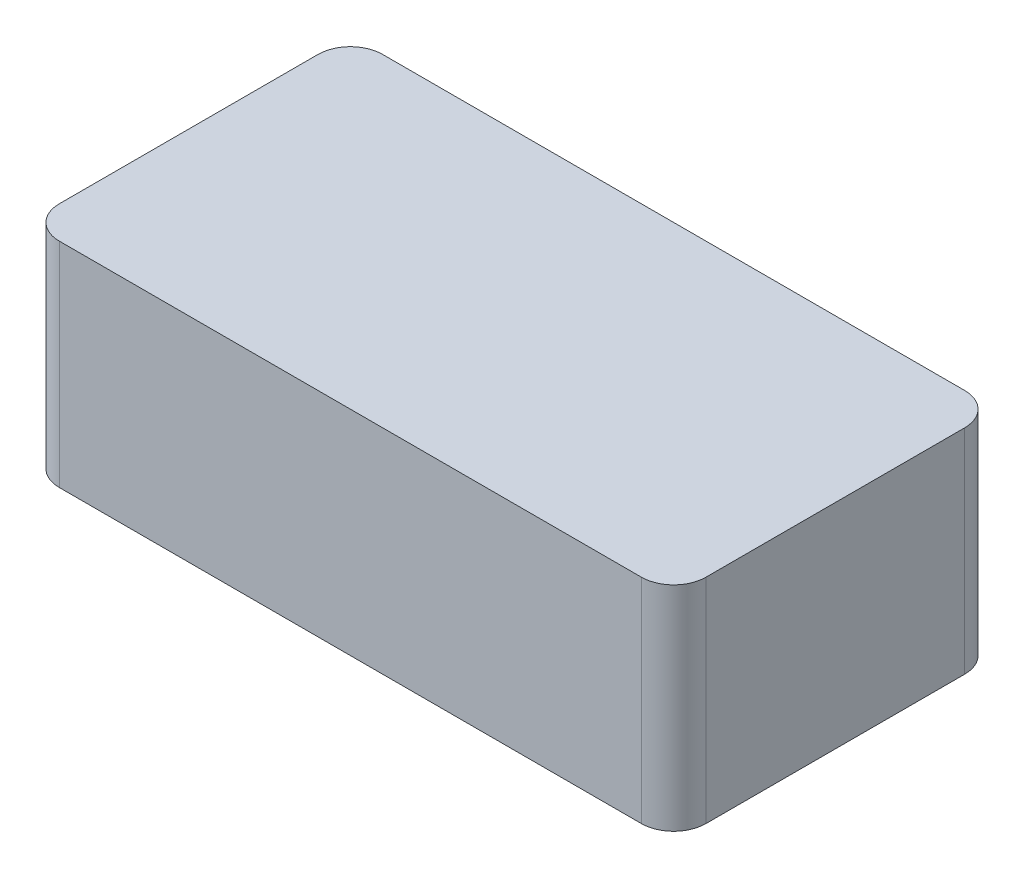
ISO-10303-21;
HEADER;
FILE_DESCRIPTION(('STEP AP214'),'2;1');
FILE_NAME('part.step','',(''),(''),'','','');
FILE_SCHEMA(('AUTOMOTIVE_DESIGN { 1 0 10303 214 1 1 1 1 }'));
ENDSEC;
DATA;
#1=APPLICATION_CONTEXT('core data for automotive mechanical design processes');
#2=APPLICATION_PROTOCOL_DEFINITION('international standard','automotive_design',2000,#1);
#3=PRODUCT_CONTEXT('',#1,'mechanical');
#4=PRODUCT('Part','Part','',(#3));
#5=PRODUCT_RELATED_PRODUCT_CATEGORY('part','',(#4));
#6=PRODUCT_DEFINITION_FORMATION('','',#4);
#7=PRODUCT_DEFINITION_CONTEXT('part definition',#1,'design');
#8=PRODUCT_DEFINITION('design','',#6,#7);
#9=PRODUCT_DEFINITION_SHAPE('','',#8);
#10=(LENGTH_UNIT() NAMED_UNIT(*) SI_UNIT(.MILLI.,.METRE.));
#11=(NAMED_UNIT(*) PLANE_ANGLE_UNIT() SI_UNIT($,.RADIAN.));
#12=(NAMED_UNIT(*) SI_UNIT($,.STERADIAN.) SOLID_ANGLE_UNIT());
#13=UNCERTAINTY_MEASURE_WITH_UNIT(LENGTH_MEASURE(1.E-05),#10,'distance_accuracy_value','');
#14=(GEOMETRIC_REPRESENTATION_CONTEXT(3) GLOBAL_UNCERTAINTY_ASSIGNED_CONTEXT((#13)) GLOBAL_UNIT_ASSIGNED_CONTEXT((#10,
#11,#12)) REPRESENTATION_CONTEXT('',''));
#15=CARTESIAN_POINT('',(0.,0.,0.));
#16=DIRECTION('',(0.,0.,1.));
#17=DIRECTION('',(1.,0.,0.));
#18=AXIS2_PLACEMENT_3D('',#15,#16,#17);
#19=CARTESIAN_POINT('',(0.,13.2,0.));
#20=DIRECTION('',(1.,0.,0.));
#21=DIRECTION('',(0.,0.,-1.));
#22=AXIS2_PLACEMENT_3D('',#19,#20,#21);
#23=PLANE('',#22);
#24=DIRECTION('',(0.,0.,1.));
#25=VECTOR('',#24,1.);
#26=CARTESIAN_POINT('',(0.,13.2,0.));
#27=LINE('',#26,#25);
#28=CARTESIAN_POINT('',(0.,13.2,-18.));
#29=VERTEX_POINT('',#28);
#30=CARTESIAN_POINT('',(0.,13.2,-2.));
#31=VERTEX_POINT('',#30);
#32=EDGE_CURVE('E123',#29,#31,#27,.T.);
#33=ORIENTED_EDGE('',*,*,#32,.F.);
#34=DIRECTION('',(0.,-1.,0.));
#35=VECTOR('',#34,1.);
#36=CARTESIAN_POINT('',(0.,13.2,-18.));
#37=LINE('',#36,#35);
#38=CARTESIAN_POINT('',(0.,0.,-18.));
#39=VERTEX_POINT('',#38);
#40=EDGE_CURVE('E108',#29,#39,#37,.T.);
#41=ORIENTED_EDGE('',*,*,#40,.T.);
#42=DIRECTION('',(0.,0.,1.));
#43=VECTOR('',#42,1.);
#44=CARTESIAN_POINT('',(0.,0.,0.));
#45=LINE('',#44,#43);
#46=CARTESIAN_POINT('',(0.,0.,-2.));
#47=VERTEX_POINT('',#46);
#48=EDGE_CURVE('E120',#39,#47,#45,.T.);
#49=ORIENTED_EDGE('',*,*,#48,.T.);
#50=DIRECTION('',(0.,-1.,0.));
#51=VECTOR('',#50,1.);
#52=CARTESIAN_POINT('',(0.,13.2,-2.));
#53=LINE('',#52,#51);
#54=EDGE_CURVE('E125',#47,#31,#53,.F.);
#55=ORIENTED_EDGE('',*,*,#54,.T.);
#56=EDGE_LOOP('',(#33,#41,#49,#55));
#57=FACE_BOUND('',#56,.T.);
#58=ADVANCED_FACE('F39',(#57),#23,.F.);
#59=CARTESIAN_POINT('',(0.,13.2,0.));
#60=DIRECTION('',(0.,0.,-1.));
#61=DIRECTION('',(-1.,0.,0.));
#62=AXIS2_PLACEMENT_3D('',#59,#60,#61);
#63=PLANE('',#62);
#64=DIRECTION('',(1.,0.,0.));
#65=VECTOR('',#64,1.);
#66=CARTESIAN_POINT('',(0.,13.2,0.));
#67=LINE('',#66,#65);
#68=CARTESIAN_POINT('',(2.,13.2,0.));
#69=VERTEX_POINT('',#68);
#70=CARTESIAN_POINT('',(38.,13.2,0.));
#71=VERTEX_POINT('',#70);
#72=EDGE_CURVE('E174',#69,#71,#67,.T.);
#73=ORIENTED_EDGE('',*,*,#72,.F.);
#74=DIRECTION('',(0.,-1.,0.));
#75=VECTOR('',#74,1.);
#76=CARTESIAN_POINT('',(2.,13.2,0.));
#77=LINE('',#76,#75);
#78=CARTESIAN_POINT('',(2.,0.,0.));
#79=VERTEX_POINT('',#78);
#80=EDGE_CURVE('E158',#69,#79,#77,.T.);
#81=ORIENTED_EDGE('',*,*,#80,.T.);
#82=DIRECTION('',(1.,0.,0.));
#83=VECTOR('',#82,1.);
#84=CARTESIAN_POINT('',(0.,0.,0.));
#85=LINE('',#84,#83);
#86=CARTESIAN_POINT('',(38.,0.,0.));
#87=VERTEX_POINT('',#86);
#88=EDGE_CURVE('E129',#79,#87,#85,.T.);
#89=ORIENTED_EDGE('',*,*,#88,.T.);
#90=DIRECTION('',(0.,-1.,0.));
#91=VECTOR('',#90,1.);
#92=CARTESIAN_POINT('',(38.,13.2,0.));
#93=LINE('',#92,#91);
#94=EDGE_CURVE('E156',#87,#71,#93,.F.);
#95=ORIENTED_EDGE('',*,*,#94,.T.);
#96=EDGE_LOOP('',(#73,#81,#89,#95));
#97=FACE_BOUND('',#96,.T.);
#98=ADVANCED_FACE('F184',(#97),#63,.F.);
#99=CARTESIAN_POINT('',(40.,13.2,0.));
#100=DIRECTION('',(-1.,0.,0.));
#101=DIRECTION('',(0.,0.,1.));
#102=AXIS2_PLACEMENT_3D('',#99,#100,#101);
#103=PLANE('',#102);
#104=DIRECTION('',(0.,0.,-1.));
#105=VECTOR('',#104,1.);
#106=CARTESIAN_POINT('',(40.,0.,0.));
#107=LINE('',#106,#105);
#108=CARTESIAN_POINT('',(40.,0.,-2.));
#109=VERTEX_POINT('',#108);
#110=CARTESIAN_POINT('',(40.,0.,-18.));
#111=VERTEX_POINT('',#110);
#112=EDGE_CURVE('E132',#109,#111,#107,.T.);
#113=ORIENTED_EDGE('',*,*,#112,.T.);
#114=DIRECTION('',(0.,-1.,0.));
#115=VECTOR('',#114,1.);
#116=CARTESIAN_POINT('',(40.,13.2,-18.));
#117=LINE('',#116,#115);
#118=CARTESIAN_POINT('',(40.,13.2,-18.));
#119=VERTEX_POINT('',#118);
#120=EDGE_CURVE('E11',#111,#119,#117,.F.);
#121=ORIENTED_EDGE('',*,*,#120,.T.);
#122=DIRECTION('',(0.,0.,-1.));
#123=VECTOR('',#122,1.);
#124=CARTESIAN_POINT('',(40.,13.2,0.));
#125=LINE('',#124,#123);
#126=CARTESIAN_POINT('',(40.,13.2,-2.));
#127=VERTEX_POINT('',#126);
#128=EDGE_CURVE('E164',#127,#119,#125,.T.);
#129=ORIENTED_EDGE('',*,*,#128,.F.);
#130=DIRECTION('',(0.,-1.,0.));
#131=VECTOR('',#130,1.);
#132=CARTESIAN_POINT('',(40.,13.2,-2.));
#133=LINE('',#132,#131);
#134=EDGE_CURVE('E47',#127,#109,#133,.T.);
#135=ORIENTED_EDGE('',*,*,#134,.T.);
#136=EDGE_LOOP('',(#113,#121,#129,#135));
#137=FACE_BOUND('',#136,.T.);
#138=ADVANCED_FACE('F163',(#137),#103,.F.);
#139=CARTESIAN_POINT('',(0.,13.2,-20.));
#140=DIRECTION('',(0.,0.,1.));
#141=DIRECTION('',(1.,0.,0.));
#142=AXIS2_PLACEMENT_3D('',#139,#140,#141);
#143=PLANE('',#142);
#144=DIRECTION('',(-1.,0.,0.));
#145=VECTOR('',#144,1.);
#146=CARTESIAN_POINT('',(0.,0.,-20.));
#147=LINE('',#146,#145);
#148=CARTESIAN_POINT('',(38.,0.,-20.));
#149=VERTEX_POINT('',#148);
#150=CARTESIAN_POINT('',(2.,0.,-20.));
#151=VERTEX_POINT('',#150);
#152=EDGE_CURVE('E139',#149,#151,#147,.T.);
#153=ORIENTED_EDGE('',*,*,#152,.T.);
#154=DIRECTION('',(0.,-1.,0.));
#155=VECTOR('',#154,1.);
#156=CARTESIAN_POINT('',(2.,13.2,-20.));
#157=LINE('',#156,#155);
#158=CARTESIAN_POINT('',(2.,13.2,-20.));
#159=VERTEX_POINT('',#158);
#160=EDGE_CURVE('E109',#151,#159,#157,.F.);
#161=ORIENTED_EDGE('',*,*,#160,.T.);
#162=DIRECTION('',(-1.,0.,0.));
#163=VECTOR('',#162,1.);
#164=CARTESIAN_POINT('',(0.,13.2,-20.));
#165=LINE('',#164,#163);
#166=CARTESIAN_POINT('',(38.,13.2,-20.));
#167=VERTEX_POINT('',#166);
#168=EDGE_CURVE('E135',#167,#159,#165,.T.);
#169=ORIENTED_EDGE('',*,*,#168,.F.);
#170=DIRECTION('',(0.,-1.,0.));
#171=VECTOR('',#170,1.);
#172=CARTESIAN_POINT('',(38.,13.2,-20.));
#173=LINE('',#172,#171);
#174=EDGE_CURVE('E114',#167,#149,#173,.T.);
#175=ORIENTED_EDGE('',*,*,#174,.T.);
#176=EDGE_LOOP('',(#153,#161,#169,#175));
#177=FACE_BOUND('',#176,.T.);
#178=ADVANCED_FACE('F172',(#177),#143,.F.);
#179=CARTESIAN_POINT('',(0.,13.2,0.));
#180=DIRECTION('',(0.,-1.,0.));
#181=DIRECTION('',(0.,0.,-1.));
#182=AXIS2_PLACEMENT_3D('',#179,#180,#181);
#183=PLANE('',#182);
#184=ORIENTED_EDGE('',*,*,#168,.T.);
#185=CARTESIAN_POINT('',(2.,13.2,-18.));
#186=DIRECTION('',(0.,-1.,0.));
#187=DIRECTION('',(0.,0.,-1.));
#188=AXIS2_PLACEMENT_3D('',#185,#186,#187);
#189=CIRCLE('',#188,2.);
#190=EDGE_CURVE('E154',#159,#29,#189,.F.);
#191=ORIENTED_EDGE('',*,*,#190,.T.);
#192=ORIENTED_EDGE('',*,*,#32,.T.);
#193=CARTESIAN_POINT('',(2.,13.2,-2.));
#194=DIRECTION('',(0.,-1.,0.));
#195=DIRECTION('',(0.,0.,-1.));
#196=AXIS2_PLACEMENT_3D('',#193,#194,#195);
#197=CIRCLE('',#196,2.);
#198=EDGE_CURVE('E152',#31,#69,#197,.F.);
#199=ORIENTED_EDGE('',*,*,#198,.T.);
#200=ORIENTED_EDGE('',*,*,#72,.T.);
#201=CARTESIAN_POINT('',(38.,13.2,-2.));
#202=DIRECTION('',(0.,-1.,0.));
#203=DIRECTION('',(0.,0.,-1.));
#204=AXIS2_PLACEMENT_3D('',#201,#202,#203);
#205=CIRCLE('',#204,2.);
#206=EDGE_CURVE('E59',#71,#127,#205,.F.);
#207=ORIENTED_EDGE('',*,*,#206,.T.);
#208=ORIENTED_EDGE('',*,*,#128,.T.);
#209=CARTESIAN_POINT('',(38.,13.2,-18.));
#210=DIRECTION('',(0.,-1.,0.));
#211=DIRECTION('',(0.,0.,-1.));
#212=AXIS2_PLACEMENT_3D('',#209,#210,#211);
#213=CIRCLE('',#212,2.);
#214=EDGE_CURVE('E150',#119,#167,#213,.F.);
#215=ORIENTED_EDGE('',*,*,#214,.T.);
#216=EDGE_LOOP('',(#184,#191,#192,#199,#200,#207,#208,#215));
#217=FACE_BOUND('',#216,.T.);
#218=ADVANCED_FACE('F178',(#217),#183,.F.);
#219=CARTESIAN_POINT('',(0.,0.,0.));
#220=DIRECTION('',(0.,-1.,0.));
#221=DIRECTION('',(0.,0.,-1.));
#222=AXIS2_PLACEMENT_3D('',#219,#220,#221);
#223=PLANE('',#222);
#224=ORIENTED_EDGE('',*,*,#48,.F.);
#225=CARTESIAN_POINT('',(2.,0.,-18.));
#226=DIRECTION('',(0.,-1.,0.));
#227=DIRECTION('',(0.,0.,-1.));
#228=AXIS2_PLACEMENT_3D('',#225,#226,#227);
#229=CIRCLE('',#228,2.);
#230=EDGE_CURVE('E104',#39,#151,#229,.T.);
#231=ORIENTED_EDGE('',*,*,#230,.T.);
#232=ORIENTED_EDGE('',*,*,#152,.F.);
#233=CARTESIAN_POINT('',(38.,0.,-18.));
#234=DIRECTION('',(0.,-1.,0.));
#235=DIRECTION('',(0.,0.,-1.));
#236=AXIS2_PLACEMENT_3D('',#233,#234,#235);
#237=CIRCLE('',#236,2.);
#238=EDGE_CURVE('E143',#149,#111,#237,.T.);
#239=ORIENTED_EDGE('',*,*,#238,.T.);
#240=ORIENTED_EDGE('',*,*,#112,.F.);
#241=CARTESIAN_POINT('',(38.,0.,-2.));
#242=DIRECTION('',(0.,-1.,0.));
#243=DIRECTION('',(0.,0.,-1.));
#244=AXIS2_PLACEMENT_3D('',#241,#242,#243);
#245=CIRCLE('',#244,2.);
#246=EDGE_CURVE('E124',#109,#87,#245,.T.);
#247=ORIENTED_EDGE('',*,*,#246,.T.);
#248=ORIENTED_EDGE('',*,*,#88,.F.);
#249=CARTESIAN_POINT('',(2.,0.,-2.));
#250=DIRECTION('',(0.,-1.,0.));
#251=DIRECTION('',(0.,0.,-1.));
#252=AXIS2_PLACEMENT_3D('',#249,#250,#251);
#253=CIRCLE('',#252,2.);
#254=EDGE_CURVE('E115',#79,#47,#253,.T.);
#255=ORIENTED_EDGE('',*,*,#254,.T.);
#256=EDGE_LOOP('',(#224,#231,#232,#239,#240,#247,#248,#255));
#257=FACE_BOUND('',#256,.T.);
#258=ADVANCED_FACE('F127',(#257),#223,.T.);
#259=CARTESIAN_POINT('',(2.,13.2,-18.));
#260=DIRECTION('',(0.,-1.,0.));
#261=DIRECTION('',(0.,0.,-1.));
#262=AXIS2_PLACEMENT_3D('',#259,#260,#261);
#263=CYLINDRICAL_SURFACE('',#262,2.);
#264=ORIENTED_EDGE('',*,*,#190,.F.);
#265=ORIENTED_EDGE('',*,*,#160,.F.);
#266=ORIENTED_EDGE('',*,*,#230,.F.);
#267=ORIENTED_EDGE('',*,*,#40,.F.);
#268=EDGE_LOOP('',(#264,#265,#266,#267));
#269=FACE_BOUND('',#268,.T.);
#270=ADVANCED_FACE('F107',(#269),#263,.T.);
#271=CARTESIAN_POINT('',(2.,13.2,-2.));
#272=DIRECTION('',(0.,-1.,0.));
#273=DIRECTION('',(0.,0.,-1.));
#274=AXIS2_PLACEMENT_3D('',#271,#272,#273);
#275=CYLINDRICAL_SURFACE('',#274,2.);
#276=ORIENTED_EDGE('',*,*,#198,.F.);
#277=ORIENTED_EDGE('',*,*,#54,.F.);
#278=ORIENTED_EDGE('',*,*,#254,.F.);
#279=ORIENTED_EDGE('',*,*,#80,.F.);
#280=EDGE_LOOP('',(#276,#277,#278,#279));
#281=FACE_BOUND('',#280,.T.);
#282=ADVANCED_FACE('F182',(#281),#275,.T.);
#283=CARTESIAN_POINT('',(38.,13.2,-18.));
#284=DIRECTION('',(0.,-1.,0.));
#285=DIRECTION('',(0.,0.,-1.));
#286=AXIS2_PLACEMENT_3D('',#283,#284,#285);
#287=CYLINDRICAL_SURFACE('',#286,2.);
#288=ORIENTED_EDGE('',*,*,#214,.F.);
#289=ORIENTED_EDGE('',*,*,#120,.F.);
#290=ORIENTED_EDGE('',*,*,#238,.F.);
#291=ORIENTED_EDGE('',*,*,#174,.F.);
#292=EDGE_LOOP('',(#288,#289,#290,#291));
#293=FACE_BOUND('',#292,.T.);
#294=ADVANCED_FACE('F169',(#293),#287,.T.);
#295=CARTESIAN_POINT('',(38.,13.2,-2.));
#296=DIRECTION('',(0.,-1.,0.));
#297=DIRECTION('',(0.,0.,-1.));
#298=AXIS2_PLACEMENT_3D('',#295,#296,#297);
#299=CYLINDRICAL_SURFACE('',#298,2.);
#300=ORIENTED_EDGE('',*,*,#206,.F.);
#301=ORIENTED_EDGE('',*,*,#94,.F.);
#302=ORIENTED_EDGE('',*,*,#246,.F.);
#303=ORIENTED_EDGE('',*,*,#134,.F.);
#304=EDGE_LOOP('',(#300,#301,#302,#303));
#305=FACE_BOUND('',#304,.T.);
#306=ADVANCED_FACE('F41',(#305),#299,.T.);
#307=CLOSED_SHELL('',(#58,#98,#138,#178,#218,#258,#270,#282,#294,#306));
#308=MANIFOLD_SOLID_BREP('B2',#307);
#309=ADVANCED_BREP_SHAPE_REPRESENTATION('',(#18,#308),#14);
#310=SHAPE_DEFINITION_REPRESENTATION(#9,#309);
ENDSEC;
END-ISO-10303-21;
